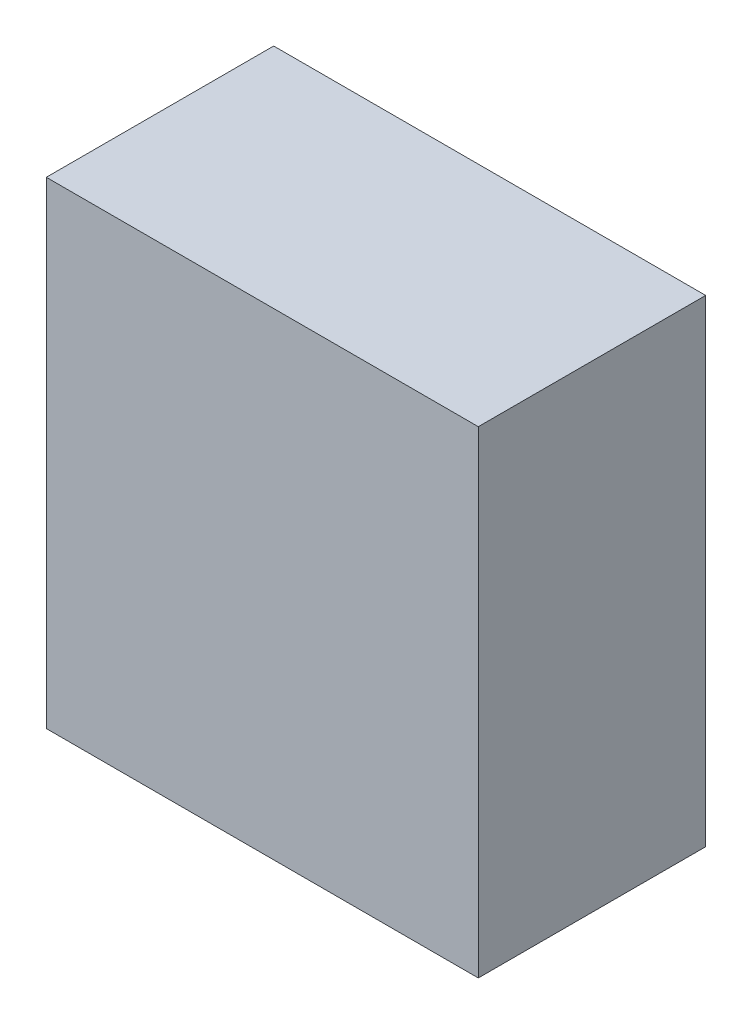
ISO-10303-21;
HEADER;
FILE_DESCRIPTION(('STEP AP214'),'2;1');
FILE_NAME('part.step','',(''),(''),'','','');
FILE_SCHEMA(('AUTOMOTIVE_DESIGN { 1 0 10303 214 1 1 1 1 }'));
ENDSEC;
DATA;
#1=APPLICATION_CONTEXT('core data for automotive mechanical design processes');
#2=APPLICATION_PROTOCOL_DEFINITION('international standard','automotive_design',2000,#1);
#3=PRODUCT_CONTEXT('',#1,'mechanical');
#4=PRODUCT('Part','Part','',(#3));
#5=PRODUCT_RELATED_PRODUCT_CATEGORY('part','',(#4));
#6=PRODUCT_DEFINITION_FORMATION('','',#4);
#7=PRODUCT_DEFINITION_CONTEXT('part definition',#1,'design');
#8=PRODUCT_DEFINITION('design','',#6,#7);
#9=PRODUCT_DEFINITION_SHAPE('','',#8);
#10=(LENGTH_UNIT() NAMED_UNIT(*) SI_UNIT(.MILLI.,.METRE.));
#11=(NAMED_UNIT(*) PLANE_ANGLE_UNIT() SI_UNIT($,.RADIAN.));
#12=(NAMED_UNIT(*) SI_UNIT($,.STERADIAN.) SOLID_ANGLE_UNIT());
#13=UNCERTAINTY_MEASURE_WITH_UNIT(LENGTH_MEASURE(1.E-05),#10,'distance_accuracy_value','');
#14=(GEOMETRIC_REPRESENTATION_CONTEXT(3) GLOBAL_UNCERTAINTY_ASSIGNED_CONTEXT((#13)) GLOBAL_UNIT_ASSIGNED_CONTEXT((#10,
#11,#12)) REPRESENTATION_CONTEXT('',''));
#15=CARTESIAN_POINT('',(0.,0.,0.));
#16=DIRECTION('',(0.,0.,1.));
#17=DIRECTION('',(1.,0.,0.));
#18=AXIS2_PLACEMENT_3D('',#15,#16,#17);
#19=CARTESIAN_POINT('',(-0.47500032,-0.52500022,0.499999));
#20=DIRECTION('',(0.,0.,-1.));
#21=DIRECTION('',(-1.,0.,0.));
#22=AXIS2_PLACEMENT_3D('',#19,#20,#21);
#23=PLANE('',#22);
#24=DIRECTION('',(0.,1.,0.));
#25=VECTOR('',#24,1.);
#26=CARTESIAN_POINT('',(0.47500032,-0.52500022,0.499999));
#27=LINE('',#26,#25);
#28=CARTESIAN_POINT('',(0.47500032,-0.52500022,0.499999));
#29=VERTEX_POINT('',#28);
#30=CARTESIAN_POINT('',(0.47500032,0.52500022,0.499999));
#31=VERTEX_POINT('',#30);
#32=EDGE_CURVE('E54',#29,#31,#27,.T.);
#33=ORIENTED_EDGE('',*,*,#32,.T.);
#34=DIRECTION('',(1.,0.,0.));
#35=VECTOR('',#34,1.);
#36=CARTESIAN_POINT('',(0.47500032,0.52500022,0.499999));
#37=LINE('',#36,#35);
#38=CARTESIAN_POINT('',(-0.47500032,0.52500022,0.499999));
#39=VERTEX_POINT('',#38);
#40=EDGE_CURVE('E56',#31,#39,#37,.F.);
#41=ORIENTED_EDGE('',*,*,#40,.T.);
#42=DIRECTION('',(0.,1.,0.));
#43=VECTOR('',#42,1.);
#44=CARTESIAN_POINT('',(-0.47500032,0.52500022,0.499999));
#45=LINE('',#44,#43);
#46=CARTESIAN_POINT('',(-0.47500032,-0.52500022,0.499999));
#47=VERTEX_POINT('',#46);
#48=EDGE_CURVE('E19',#39,#47,#45,.F.);
#49=ORIENTED_EDGE('',*,*,#48,.T.);
#50=DIRECTION('',(1.,0.,0.));
#51=VECTOR('',#50,1.);
#52=CARTESIAN_POINT('',(-0.47500032,-0.52500022,0.499999));
#53=LINE('',#52,#51);
#54=EDGE_CURVE('E79',#47,#29,#53,.T.);
#55=ORIENTED_EDGE('',*,*,#54,.T.);
#56=EDGE_LOOP('',(#33,#41,#49,#55));
#57=FACE_BOUND('',#56,.T.);
#58=ADVANCED_FACE('F16',(#57),#23,.F.);
#59=CARTESIAN_POINT('',(-0.47500032,0.52500022,0.));
#60=DIRECTION('',(1.,0.,0.));
#61=DIRECTION('',(0.,0.,-1.));
#62=AXIS2_PLACEMENT_3D('',#59,#60,#61);
#63=PLANE('',#62);
#64=DIRECTION('',(0.,0.,1.));
#65=VECTOR('',#64,1.);
#66=CARTESIAN_POINT('',(-0.47500032,-0.52500022,0.));
#67=LINE('',#66,#65);
#68=CARTESIAN_POINT('',(-0.47500032,-0.52500022,0.));
#69=VERTEX_POINT('',#68);
#70=EDGE_CURVE('E67',#69,#47,#67,.T.);
#71=ORIENTED_EDGE('',*,*,#70,.T.);
#72=ORIENTED_EDGE('',*,*,#48,.F.);
#73=DIRECTION('',(0.,0.,-1.));
#74=VECTOR('',#73,1.);
#75=CARTESIAN_POINT('',(-0.47500032,0.52500022,0.));
#76=LINE('',#75,#74);
#77=CARTESIAN_POINT('',(-0.47500032,0.52500022,0.));
#78=VERTEX_POINT('',#77);
#79=EDGE_CURVE('E62',#39,#78,#76,.T.);
#80=ORIENTED_EDGE('',*,*,#79,.T.);
#81=DIRECTION('',(0.,1.,0.));
#82=VECTOR('',#81,1.);
#83=CARTESIAN_POINT('',(-0.47500032,-0.52500022,0.));
#84=LINE('',#83,#82);
#85=EDGE_CURVE('E82',#69,#78,#84,.T.);
#86=ORIENTED_EDGE('',*,*,#85,.F.);
#87=EDGE_LOOP('',(#71,#72,#80,#86));
#88=FACE_BOUND('',#87,.T.);
#89=ADVANCED_FACE('F64',(#88),#63,.F.);
#90=CARTESIAN_POINT('',(0.47500032,0.52500022,0.));
#91=DIRECTION('',(0.,-1.,0.));
#92=DIRECTION('',(0.,0.,-1.));
#93=AXIS2_PLACEMENT_3D('',#90,#91,#92);
#94=PLANE('',#93);
#95=ORIENTED_EDGE('',*,*,#79,.F.);
#96=ORIENTED_EDGE('',*,*,#40,.F.);
#97=DIRECTION('',(0.,0.,1.));
#98=VECTOR('',#97,1.);
#99=CARTESIAN_POINT('',(0.47500032,0.52500022,0.));
#100=LINE('',#99,#98);
#101=CARTESIAN_POINT('',(0.47500032,0.52500022,0.));
#102=VERTEX_POINT('',#101);
#103=EDGE_CURVE('E74',#31,#102,#100,.F.);
#104=ORIENTED_EDGE('',*,*,#103,.T.);
#105=DIRECTION('',(-1.,0.,0.));
#106=VECTOR('',#105,1.);
#107=CARTESIAN_POINT('',(-0.47500032,0.52500022,0.));
#108=LINE('',#107,#106);
#109=EDGE_CURVE('E71',#78,#102,#108,.F.);
#110=ORIENTED_EDGE('',*,*,#109,.F.);
#111=EDGE_LOOP('',(#95,#96,#104,#110));
#112=FACE_BOUND('',#111,.T.);
#113=ADVANCED_FACE('F69',(#112),#94,.F.);
#114=CARTESIAN_POINT('',(0.47500032,-0.52500022,0.));
#115=DIRECTION('',(-1.,0.,0.));
#116=DIRECTION('',(0.,0.,1.));
#117=AXIS2_PLACEMENT_3D('',#114,#115,#116);
#118=PLANE('',#117);
#119=ORIENTED_EDGE('',*,*,#103,.F.);
#120=ORIENTED_EDGE('',*,*,#32,.F.);
#121=DIRECTION('',(0.,0.,1.));
#122=VECTOR('',#121,1.);
#123=CARTESIAN_POINT('',(0.47500032,-0.52500022,0.));
#124=LINE('',#123,#122);
#125=CARTESIAN_POINT('',(0.47500032,-0.52500022,0.));
#126=VERTEX_POINT('',#125);
#127=EDGE_CURVE('E34',#29,#126,#124,.F.);
#128=ORIENTED_EDGE('',*,*,#127,.T.);
#129=DIRECTION('',(0.,1.,0.));
#130=VECTOR('',#129,1.);
#131=CARTESIAN_POINT('',(0.47500032,-0.52500022,0.));
#132=LINE('',#131,#130);
#133=EDGE_CURVE('E25',#102,#126,#132,.F.);
#134=ORIENTED_EDGE('',*,*,#133,.F.);
#135=EDGE_LOOP('',(#119,#120,#128,#134));
#136=FACE_BOUND('',#135,.T.);
#137=ADVANCED_FACE('F88',(#136),#118,.F.);
#138=CARTESIAN_POINT('',(-0.47500032,-0.52500022,0.));
#139=DIRECTION('',(0.,1.,0.));
#140=DIRECTION('',(0.,0.,1.));
#141=AXIS2_PLACEMENT_3D('',#138,#139,#140);
#142=PLANE('',#141);
#143=ORIENTED_EDGE('',*,*,#127,.F.);
#144=ORIENTED_EDGE('',*,*,#54,.F.);
#145=ORIENTED_EDGE('',*,*,#70,.F.);
#146=DIRECTION('',(-1.,0.,0.));
#147=VECTOR('',#146,1.);
#148=CARTESIAN_POINT('',(-0.47500032,-0.52500022,0.));
#149=LINE('',#148,#147);
#150=EDGE_CURVE('E11',#126,#69,#149,.T.);
#151=ORIENTED_EDGE('',*,*,#150,.F.);
#152=EDGE_LOOP('',(#143,#144,#145,#151));
#153=FACE_BOUND('',#152,.T.);
#154=ADVANCED_FACE('F90',(#153),#142,.F.);
#155=CARTESIAN_POINT('',(-0.47500032,-0.52500022,0.));
#156=DIRECTION('',(0.,0.,-1.));
#157=DIRECTION('',(-1.,0.,0.));
#158=AXIS2_PLACEMENT_3D('',#155,#156,#157);
#159=PLANE('',#158);
#160=ORIENTED_EDGE('',*,*,#133,.T.);
#161=ORIENTED_EDGE('',*,*,#150,.T.);
#162=ORIENTED_EDGE('',*,*,#85,.T.);
#163=ORIENTED_EDGE('',*,*,#109,.T.);
#164=EDGE_LOOP('',(#160,#161,#162,#163));
#165=FACE_BOUND('',#164,.T.);
#166=ADVANCED_FACE('F87',(#165),#159,.T.);
#167=CLOSED_SHELL('',(#58,#89,#113,#137,#154,#166));
#168=MANIFOLD_SOLID_BREP('B1',#167);
#169=ADVANCED_BREP_SHAPE_REPRESENTATION('',(#18,#168),#14);
#170=SHAPE_DEFINITION_REPRESENTATION(#9,#169);
ENDSEC;
END-ISO-10303-21;
